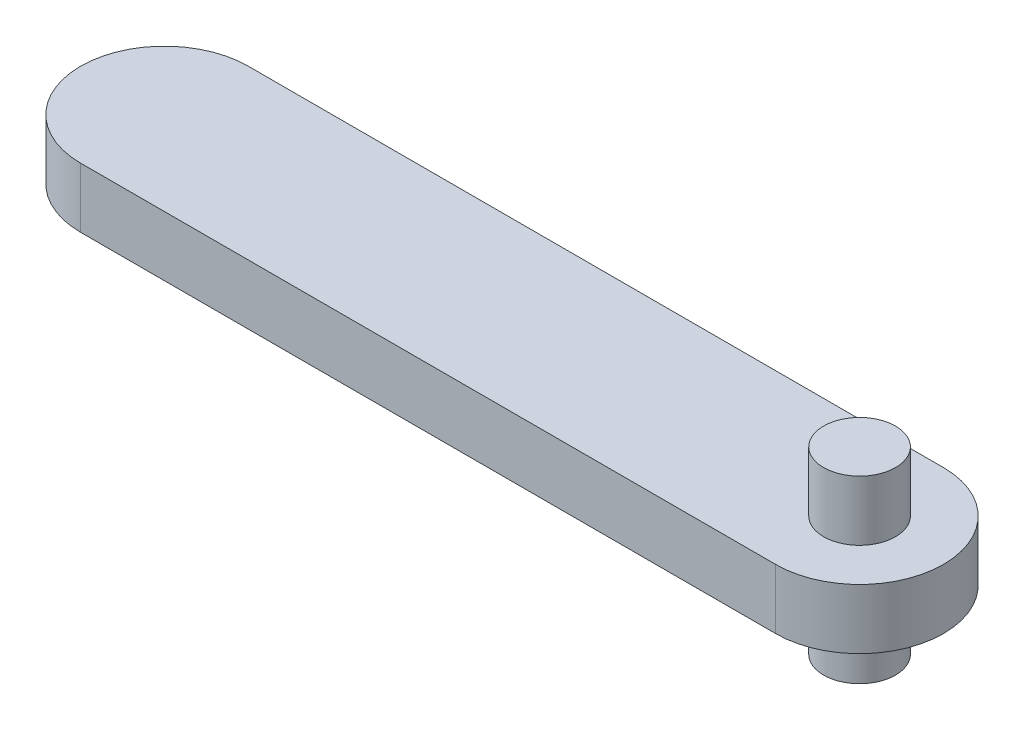
ISO-10303-21;
HEADER;
FILE_DESCRIPTION(('STEP AP214'),'2;1');
FILE_NAME('part.step','',(''),(''),'','','');
FILE_SCHEMA(('AUTOMOTIVE_DESIGN { 1 0 10303 214 1 1 1 1 }'));
ENDSEC;
DATA;
#1=APPLICATION_CONTEXT('core data for automotive mechanical design processes');
#2=APPLICATION_PROTOCOL_DEFINITION('international standard','automotive_design',2000,#1);
#3=PRODUCT_CONTEXT('',#1,'mechanical');
#4=PRODUCT('Part','Part','',(#3));
#5=PRODUCT_RELATED_PRODUCT_CATEGORY('part','',(#4));
#6=PRODUCT_DEFINITION_FORMATION('','',#4);
#7=PRODUCT_DEFINITION_CONTEXT('part definition',#1,'design');
#8=PRODUCT_DEFINITION('design','',#6,#7);
#9=PRODUCT_DEFINITION_SHAPE('','',#8);
#10=(LENGTH_UNIT() NAMED_UNIT(*) SI_UNIT(.MILLI.,.METRE.));
#11=(NAMED_UNIT(*) PLANE_ANGLE_UNIT() SI_UNIT($,.RADIAN.));
#12=(NAMED_UNIT(*) SI_UNIT($,.STERADIAN.) SOLID_ANGLE_UNIT());
#13=UNCERTAINTY_MEASURE_WITH_UNIT(LENGTH_MEASURE(1.E-05),#10,'distance_accuracy_value','');
#14=(GEOMETRIC_REPRESENTATION_CONTEXT(3) GLOBAL_UNCERTAINTY_ASSIGNED_CONTEXT((#13)) GLOBAL_UNIT_ASSIGNED_CONTEXT((#10,
#11,#12)) REPRESENTATION_CONTEXT('',''));
#15=CARTESIAN_POINT('',(0.,0.,0.));
#16=DIRECTION('',(0.,0.,1.));
#17=DIRECTION('',(1.,0.,0.));
#18=AXIS2_PLACEMENT_3D('',#15,#16,#17);
#19=CARTESIAN_POINT('',(-429.944100226293,125.,-107.40077744332));
#20=DIRECTION('',(0.,1.,0.));
#21=DIRECTION('',(0.,0.,1.));
#22=AXIS2_PLACEMENT_3D('',#19,#20,#21);
#23=CYLINDRICAL_SURFACE('',#22,35.);
#24=CARTESIAN_POINT('',(-429.944100226293,125.,-107.40077744332));
#25=DIRECTION('',(0.,-1.,0.));
#26=DIRECTION('',(0.,0.,1.));
#27=AXIS2_PLACEMENT_3D('',#24,#25,#26);
#28=CIRCLE('',#27,35.);
#29=CARTESIAN_POINT('',(-429.944100226293,125.,-142.40077744332));
#30=VERTEX_POINT('',#29);
#31=CARTESIAN_POINT('',(-429.944100226293,125.,-72.4007774433196));
#32=VERTEX_POINT('',#31);
#33=EDGE_CURVE('E89',#30,#32,#28,.T.);
#34=ORIENTED_EDGE('',*,*,#33,.F.);
#35=DIRECTION('',(0.,1.,0.));
#36=VECTOR('',#35,1.);
#37=CARTESIAN_POINT('',(-429.944100226293,125.,-142.40077744332));
#38=LINE('',#37,#36);
#39=CARTESIAN_POINT('',(-429.944100226293,150.,-142.40077744332));
#40=VERTEX_POINT('',#39);
#41=EDGE_CURVE('E94',#30,#40,#38,.T.);
#42=ORIENTED_EDGE('',*,*,#41,.T.);
#43=CARTESIAN_POINT('',(-429.944100226293,150.,-107.40077744332));
#44=DIRECTION('',(0.,1.,0.));
#45=DIRECTION('',(0.,0.,1.));
#46=AXIS2_PLACEMENT_3D('',#43,#44,#45);
#47=CIRCLE('',#46,35.);
#48=CARTESIAN_POINT('',(-429.944100226293,150.,-72.4007774433196));
#49=VERTEX_POINT('',#48);
#50=EDGE_CURVE('E91',#49,#40,#47,.T.);
#51=ORIENTED_EDGE('',*,*,#50,.F.);
#52=DIRECTION('',(0.,1.,0.));
#53=VECTOR('',#52,1.);
#54=CARTESIAN_POINT('',(-429.944100226293,125.,-72.4007774433196));
#55=LINE('',#54,#53);
#56=EDGE_CURVE('E79',#32,#49,#55,.T.);
#57=ORIENTED_EDGE('',*,*,#56,.F.);
#58=EDGE_LOOP('',(#34,#42,#51,#57));
#59=FACE_BOUND('',#58,.T.);
#60=ADVANCED_FACE('F42',(#59),#23,.T.);
#61=CARTESIAN_POINT('',(-489.944100226293,150.,-107.40077744332));
#62=DIRECTION('',(0.,1.,0.));
#63=DIRECTION('',(1.,0.,0.));
#64=AXIS2_PLACEMENT_3D('',#61,#62,#63);
#65=PLANE('',#64);
#66=CARTESIAN_POINT('',(-429.944100226293,150.,-107.40077744332));
#67=DIRECTION('',(0.,-1.,0.));
#68=DIRECTION('',(1.,0.,0.));
#69=AXIS2_PLACEMENT_3D('',#66,#67,#68);
#70=CIRCLE('',#69,15.);
#71=CARTESIAN_POINT('',(-414.944100226293,150.,-107.40077744332));
#72=VERTEX_POINT('',#71);
#73=EDGE_CURVE('E109',#72,#72,#70,.T.);
#74=ORIENTED_EDGE('',*,*,#73,.T.);
#75=EDGE_LOOP('',(#74));
#76=FACE_BOUND('',#75,.T.);
#77=DIRECTION('',(-1.,0.,0.));
#78=VECTOR('',#77,1.);
#79=CARTESIAN_POINT('',(-459.944100226293,150.,-142.40077744332));
#80=LINE('',#79,#78);
#81=CARTESIAN_POINT('',(-719.944100226293,150.,-142.40077744332));
#82=VERTEX_POINT('',#81);
#83=EDGE_CURVE('E96',#40,#82,#80,.T.);
#84=ORIENTED_EDGE('',*,*,#83,.T.);
#85=CARTESIAN_POINT('',(-719.944100226293,150.,-107.40077744332));
#86=DIRECTION('',(0.,1.,0.));
#87=DIRECTION('',(0.,0.,-1.));
#88=AXIS2_PLACEMENT_3D('',#85,#86,#87);
#89=CIRCLE('',#88,35.);
#90=CARTESIAN_POINT('',(-719.944100226293,150.,-72.4007774433196));
#91=VERTEX_POINT('',#90);
#92=EDGE_CURVE('E118',#82,#91,#89,.T.);
#93=ORIENTED_EDGE('',*,*,#92,.T.);
#94=DIRECTION('',(1.,0.,0.));
#95=VECTOR('',#94,1.);
#96=CARTESIAN_POINT('',(-519.944100226293,150.,-72.4007774433196));
#97=LINE('',#96,#95);
#98=EDGE_CURVE('E85',#91,#49,#97,.T.);
#99=ORIENTED_EDGE('',*,*,#98,.T.);
#100=ORIENTED_EDGE('',*,*,#50,.T.);
#101=EDGE_LOOP('',(#84,#93,#99,#100));
#102=FACE_BOUND('',#101,.T.);
#103=ADVANCED_FACE('F129',(#76,#102),#65,.T.);
#104=CARTESIAN_POINT('',(-429.944100226293,175.,-107.40077744332));
#105=DIRECTION('',(0.,1.,0.));
#106=DIRECTION('',(1.,0.,0.));
#107=AXIS2_PLACEMENT_3D('',#104,#105,#106);
#108=PLANE('',#107);
#109=CARTESIAN_POINT('',(-429.944100226293,175.,-107.40077744332));
#110=DIRECTION('',(0.,-1.,0.));
#111=DIRECTION('',(1.,0.,0.));
#112=AXIS2_PLACEMENT_3D('',#109,#110,#111);
#113=CIRCLE('',#112,15.);
#114=CARTESIAN_POINT('',(-414.944100226293,175.,-107.40077744332));
#115=VERTEX_POINT('',#114);
#116=EDGE_CURVE('E102',#115,#115,#113,.T.);
#117=ORIENTED_EDGE('',*,*,#116,.F.);
#118=EDGE_LOOP('',(#117));
#119=FACE_BOUND('',#118,.T.);
#120=ADVANCED_FACE('F131',(#119),#108,.T.);
#121=CARTESIAN_POINT('',(-429.944100226293,100.,-107.40077744332));
#122=DIRECTION('',(0.,1.,0.));
#123=DIRECTION('',(1.,0.,0.));
#124=AXIS2_PLACEMENT_3D('',#121,#122,#123);
#125=CYLINDRICAL_SURFACE('',#124,15.);
#126=ORIENTED_EDGE('',*,*,#73,.F.);
#127=EDGE_LOOP('',(#126));
#128=FACE_BOUND('',#127,.T.);
#129=ORIENTED_EDGE('',*,*,#116,.T.);
#130=EDGE_LOOP('',(#129));
#131=FACE_BOUND('',#130,.T.);
#132=ADVANCED_FACE('F137',(#128,#131),#125,.T.);
#133=CARTESIAN_POINT('',(-429.944100226293,100.,-107.40077744332));
#134=DIRECTION('',(0.,-1.,0.));
#135=DIRECTION('',(0.,0.,-1.));
#136=AXIS2_PLACEMENT_3D('',#133,#134,#135);
#137=PLANE('',#136);
#138=CARTESIAN_POINT('',(-429.944100226293,100.,-107.40077744332));
#139=DIRECTION('',(0.,1.,0.));
#140=DIRECTION('',(1.,0.,0.));
#141=AXIS2_PLACEMENT_3D('',#138,#139,#140);
#142=CIRCLE('',#141,15.);
#143=CARTESIAN_POINT('',(-414.944100226293,100.,-107.40077744332));
#144=VERTEX_POINT('',#143);
#145=EDGE_CURVE('E52',#144,#144,#142,.T.);
#146=ORIENTED_EDGE('',*,*,#145,.F.);
#147=EDGE_LOOP('',(#146));
#148=FACE_BOUND('',#147,.T.);
#149=ADVANCED_FACE('F159',(#148),#137,.T.);
#150=CARTESIAN_POINT('',(-489.944100226293,125.,-107.40077744332));
#151=DIRECTION('',(0.,1.,0.));
#152=DIRECTION('',(1.,0.,0.));
#153=AXIS2_PLACEMENT_3D('',#150,#151,#152);
#154=PLANE('',#153);
#155=CARTESIAN_POINT('',(-429.944100226293,125.,-107.40077744332));
#156=DIRECTION('',(0.,1.,0.));
#157=DIRECTION('',(1.,0.,0.));
#158=AXIS2_PLACEMENT_3D('',#155,#156,#157);
#159=CIRCLE('',#158,15.);
#160=CARTESIAN_POINT('',(-414.944100226293,125.,-107.40077744332));
#161=VERTEX_POINT('',#160);
#162=EDGE_CURVE('E11',#161,#161,#159,.T.);
#163=ORIENTED_EDGE('',*,*,#162,.T.);
#164=EDGE_LOOP('',(#163));
#165=FACE_BOUND('',#164,.T.);
#166=DIRECTION('',(-1.,0.,0.));
#167=VECTOR('',#166,1.);
#168=CARTESIAN_POINT('',(-519.944100226293,125.,-72.4007774433196));
#169=LINE('',#168,#167);
#170=CARTESIAN_POINT('',(-719.944100226293,125.,-72.4007774433196));
#171=VERTEX_POINT('',#170);
#172=EDGE_CURVE('E75',#32,#171,#169,.T.);
#173=ORIENTED_EDGE('',*,*,#172,.T.);
#174=CARTESIAN_POINT('',(-719.944100226293,125.,-107.40077744332));
#175=DIRECTION('',(0.,-1.,0.));
#176=DIRECTION('',(0.,0.,-1.));
#177=AXIS2_PLACEMENT_3D('',#174,#175,#176);
#178=CIRCLE('',#177,35.);
#179=CARTESIAN_POINT('',(-719.944100226293,125.,-142.40077744332));
#180=VERTEX_POINT('',#179);
#181=EDGE_CURVE('E121',#171,#180,#178,.T.);
#182=ORIENTED_EDGE('',*,*,#181,.T.);
#183=DIRECTION('',(1.,0.,0.));
#184=VECTOR('',#183,1.);
#185=CARTESIAN_POINT('',(-459.944100226293,125.,-142.40077744332));
#186=LINE('',#185,#184);
#187=EDGE_CURVE('E46',#180,#30,#186,.T.);
#188=ORIENTED_EDGE('',*,*,#187,.T.);
#189=ORIENTED_EDGE('',*,*,#33,.T.);
#190=EDGE_LOOP('',(#173,#182,#188,#189));
#191=FACE_BOUND('',#190,.T.);
#192=ADVANCED_FACE('F93',(#165,#191),#154,.F.);
#193=CARTESIAN_POINT('',(-429.944100226293,100.,-107.40077744332));
#194=DIRECTION('',(0.,1.,0.));
#195=DIRECTION('',(1.,0.,0.));
#196=AXIS2_PLACEMENT_3D('',#193,#194,#195);
#197=CYLINDRICAL_SURFACE('',#196,15.);
#198=ORIENTED_EDGE('',*,*,#145,.T.);
#199=EDGE_LOOP('',(#198));
#200=FACE_BOUND('',#199,.T.);
#201=ORIENTED_EDGE('',*,*,#162,.F.);
#202=EDGE_LOOP('',(#201));
#203=FACE_BOUND('',#202,.T.);
#204=ADVANCED_FACE('F149',(#200,#203),#197,.T.);
#205=CARTESIAN_POINT('',(-429.944100226293,125.,-142.40077744332));
#206=DIRECTION('',(0.,0.,-1.));
#207=DIRECTION('',(0.,-1.,0.));
#208=AXIS2_PLACEMENT_3D('',#205,#206,#207);
#209=PLANE('',#208);
#210=ORIENTED_EDGE('',*,*,#187,.F.);
#211=DIRECTION('',(0.,1.,0.));
#212=VECTOR('',#211,1.);
#213=CARTESIAN_POINT('',(-719.944100226293,125.,-142.40077744332));
#214=LINE('',#213,#212);
#215=EDGE_CURVE('E103',#180,#82,#214,.T.);
#216=ORIENTED_EDGE('',*,*,#215,.T.);
#217=ORIENTED_EDGE('',*,*,#83,.F.);
#218=ORIENTED_EDGE('',*,*,#41,.F.);
#219=EDGE_LOOP('',(#210,#216,#217,#218));
#220=FACE_BOUND('',#219,.T.);
#221=ADVANCED_FACE('F44',(#220),#209,.T.);
#222=CARTESIAN_POINT('',(-549.944100226293,125.,-72.4007774433196));
#223=DIRECTION('',(0.,0.,1.));
#224=DIRECTION('',(1.,0.,0.));
#225=AXIS2_PLACEMENT_3D('',#222,#223,#224);
#226=PLANE('',#225);
#227=ORIENTED_EDGE('',*,*,#98,.F.);
#228=DIRECTION('',(0.,1.,0.));
#229=VECTOR('',#228,1.);
#230=CARTESIAN_POINT('',(-719.944100226293,125.,-72.4007774433196));
#231=LINE('',#230,#229);
#232=EDGE_CURVE('E83',#171,#91,#231,.T.);
#233=ORIENTED_EDGE('',*,*,#232,.F.);
#234=ORIENTED_EDGE('',*,*,#172,.F.);
#235=ORIENTED_EDGE('',*,*,#56,.T.);
#236=EDGE_LOOP('',(#227,#233,#234,#235));
#237=FACE_BOUND('',#236,.T.);
#238=ADVANCED_FACE('F78',(#237),#226,.T.);
#239=CARTESIAN_POINT('',(-719.944100226293,125.,-107.40077744332));
#240=DIRECTION('',(0.,1.,0.));
#241=DIRECTION('',(0.,0.,-1.));
#242=AXIS2_PLACEMENT_3D('',#239,#240,#241);
#243=CYLINDRICAL_SURFACE('',#242,35.);
#244=ORIENTED_EDGE('',*,*,#181,.F.);
#245=ORIENTED_EDGE('',*,*,#232,.T.);
#246=ORIENTED_EDGE('',*,*,#92,.F.);
#247=ORIENTED_EDGE('',*,*,#215,.F.);
#248=EDGE_LOOP('',(#244,#245,#246,#247));
#249=FACE_BOUND('',#248,.T.);
#250=ADVANCED_FACE('F125',(#249),#243,.T.);
#251=CLOSED_SHELL('',(#60,#103,#120,#132,#149,#192,#204,#221,#238,#250));
#252=MANIFOLD_SOLID_BREP('B2',#251);
#253=ADVANCED_BREP_SHAPE_REPRESENTATION('',(#18,#252),#14);
#254=SHAPE_DEFINITION_REPRESENTATION(#9,#253);
ENDSEC;
END-ISO-10303-21;
